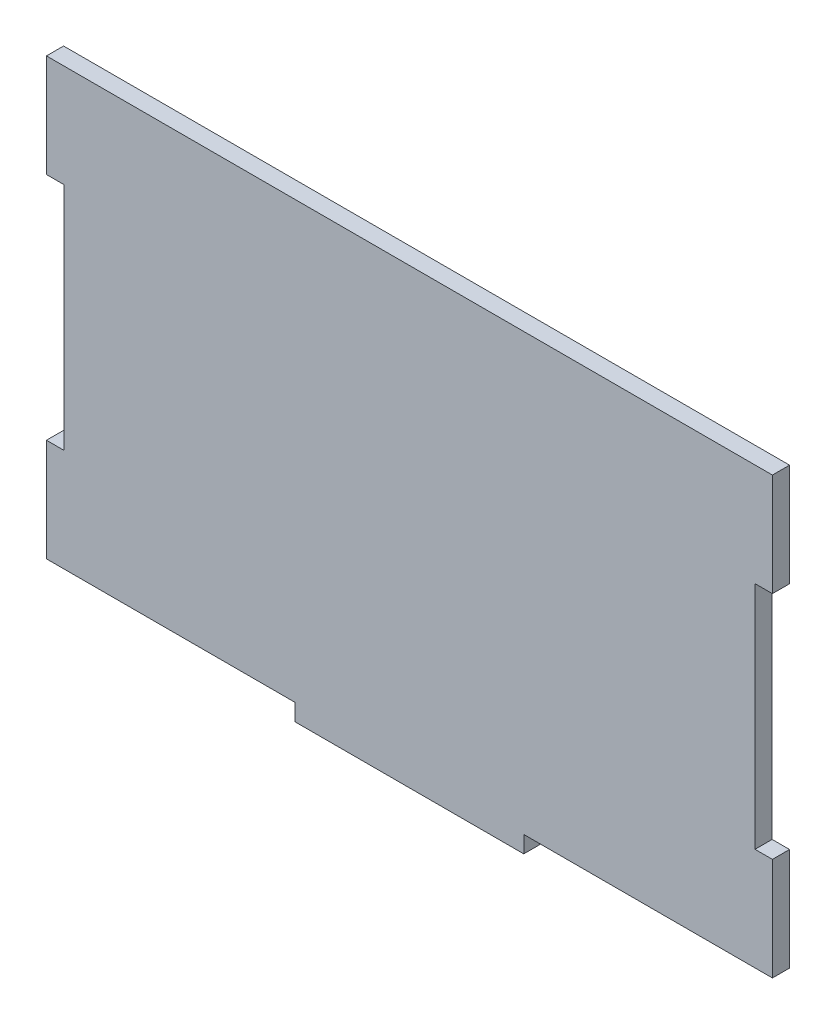
ISO-10303-21;
HEADER;
FILE_DESCRIPTION(('STEP AP214'),'2;1');
FILE_NAME('part.step','',(''),(''),'','','');
FILE_SCHEMA(('AUTOMOTIVE_DESIGN { 1 0 10303 214 1 1 1 1 }'));
ENDSEC;
DATA;
#1=APPLICATION_CONTEXT('core data for automotive mechanical design processes');
#2=APPLICATION_PROTOCOL_DEFINITION('international standard','automotive_design',2000,#1);
#3=PRODUCT_CONTEXT('',#1,'mechanical');
#4=PRODUCT('Part','Part','',(#3));
#5=PRODUCT_RELATED_PRODUCT_CATEGORY('part','',(#4));
#6=PRODUCT_DEFINITION_FORMATION('','',#4);
#7=PRODUCT_DEFINITION_CONTEXT('part definition',#1,'design');
#8=PRODUCT_DEFINITION('design','',#6,#7);
#9=PRODUCT_DEFINITION_SHAPE('','',#8);
#10=(LENGTH_UNIT() NAMED_UNIT(*) SI_UNIT(.MILLI.,.METRE.));
#11=(NAMED_UNIT(*) PLANE_ANGLE_UNIT() SI_UNIT($,.RADIAN.));
#12=(NAMED_UNIT(*) SI_UNIT($,.STERADIAN.) SOLID_ANGLE_UNIT());
#13=UNCERTAINTY_MEASURE_WITH_UNIT(LENGTH_MEASURE(1.E-05),#10,'distance_accuracy_value','');
#14=(GEOMETRIC_REPRESENTATION_CONTEXT(3) GLOBAL_UNCERTAINTY_ASSIGNED_CONTEXT((#13)) GLOBAL_UNIT_ASSIGNED_CONTEXT((#10,
#11,#12)) REPRESENTATION_CONTEXT('',''));
#15=CARTESIAN_POINT('',(0.,0.,0.));
#16=DIRECTION('',(0.,0.,1.));
#17=DIRECTION('',(1.,0.,0.));
#18=AXIS2_PLACEMENT_3D('',#15,#16,#17);
#19=CARTESIAN_POINT('',(-63.5,-38.1,1.4986));
#20=DIRECTION('',(0.,1.,0.));
#21=DIRECTION('',(0.,0.,1.));
#22=AXIS2_PLACEMENT_3D('',#19,#20,#21);
#23=PLANE('',#22);
#24=DIRECTION('',(0.,0.,1.));
#25=VECTOR('',#24,1.);
#26=CARTESIAN_POINT('',(20.,-38.1,-1.49865));
#27=LINE('',#26,#25);
#28=CARTESIAN_POINT('',(20.,-38.1,-1.4986));
#29=VERTEX_POINT('',#28);
#30=CARTESIAN_POINT('',(20.,-38.1,1.4986));
#31=VERTEX_POINT('',#30);
#32=EDGE_CURVE('E11',#29,#31,#27,.T.);
#33=ORIENTED_EDGE('',*,*,#32,.F.);
#34=DIRECTION('',(1.,0.,0.));
#35=VECTOR('',#34,1.);
#36=CARTESIAN_POINT('',(-63.5,-38.1,-1.4986));
#37=LINE('',#36,#35);
#38=CARTESIAN_POINT('',(63.5,-38.1,-1.4986));
#39=VERTEX_POINT('',#38);
#40=EDGE_CURVE('E235',#29,#39,#37,.T.);
#41=ORIENTED_EDGE('',*,*,#40,.T.);
#42=DIRECTION('',(0.,0.,-1.));
#43=VECTOR('',#42,1.);
#44=CARTESIAN_POINT('',(63.5,-38.1,1.4986));
#45=LINE('',#44,#43);
#46=CARTESIAN_POINT('',(63.5,-38.1,1.4986));
#47=VERTEX_POINT('',#46);
#48=EDGE_CURVE('E209',#47,#39,#45,.T.);
#49=ORIENTED_EDGE('',*,*,#48,.F.);
#50=DIRECTION('',(1.,0.,0.));
#51=VECTOR('',#50,1.);
#52=CARTESIAN_POINT('',(-63.5,-38.1,1.4986));
#53=LINE('',#52,#51);
#54=EDGE_CURVE('E191',#31,#47,#53,.T.);
#55=ORIENTED_EDGE('',*,*,#54,.F.);
#56=EDGE_LOOP('',(#33,#41,#49,#55));
#57=FACE_BOUND('',#56,.T.);
#58=ADVANCED_FACE('F32',(#57),#23,.F.);
#59=CARTESIAN_POINT('',(63.5,-38.1,1.4986));
#60=DIRECTION('',(-1.,0.,0.));
#61=DIRECTION('',(0.,0.,1.));
#62=AXIS2_PLACEMENT_3D('',#59,#60,#61);
#63=PLANE('',#62);
#64=DIRECTION('',(0.,1.,0.));
#65=VECTOR('',#64,1.);
#66=CARTESIAN_POINT('',(63.5,-38.1,1.4986));
#67=LINE('',#66,#65);
#68=CARTESIAN_POINT('',(63.5,20.127,1.4986));
#69=VERTEX_POINT('',#68);
#70=CARTESIAN_POINT('',(63.5,38.1,1.4986));
#71=VERTEX_POINT('',#70);
#72=EDGE_CURVE('E248',#69,#71,#67,.T.);
#73=ORIENTED_EDGE('',*,*,#72,.F.);
#74=DIRECTION('',(0.,0.,1.));
#75=VECTOR('',#74,1.);
#76=CARTESIAN_POINT('',(63.5,20.127,-1.4986));
#77=LINE('',#76,#75);
#78=CARTESIAN_POINT('',(63.5,20.127,-1.4986));
#79=VERTEX_POINT('',#78);
#80=EDGE_CURVE('E299',#79,#69,#77,.T.);
#81=ORIENTED_EDGE('',*,*,#80,.F.);
#82=DIRECTION('',(0.,1.,0.));
#83=VECTOR('',#82,1.);
#84=CARTESIAN_POINT('',(63.5,-38.1,-1.4986));
#85=LINE('',#84,#83);
#86=CARTESIAN_POINT('',(63.5,38.1,-1.4986));
#87=VERTEX_POINT('',#86);
#88=EDGE_CURVE('E230',#79,#87,#85,.T.);
#89=ORIENTED_EDGE('',*,*,#88,.T.);
#90=DIRECTION('',(0.,0.,-1.));
#91=VECTOR('',#90,1.);
#92=CARTESIAN_POINT('',(63.5,38.1,1.4986));
#93=LINE('',#92,#91);
#94=EDGE_CURVE('E190',#71,#87,#93,.T.);
#95=ORIENTED_EDGE('',*,*,#94,.F.);
#96=EDGE_LOOP('',(#73,#81,#89,#95));
#97=FACE_BOUND('',#96,.T.);
#98=ADVANCED_FACE('F342',(#97),#63,.F.);
#99=CARTESIAN_POINT('',(-63.5,-38.1,1.4986));
#100=DIRECTION('',(1.,0.,0.));
#101=DIRECTION('',(0.,0.,-1.));
#102=AXIS2_PLACEMENT_3D('',#99,#100,#101);
#103=PLANE('',#102);
#104=DIRECTION('',(0.,-1.,0.));
#105=VECTOR('',#104,1.);
#106=CARTESIAN_POINT('',(-63.5,-38.1,-1.4986));
#107=LINE('',#106,#105);
#108=CARTESIAN_POINT('',(-63.5,38.1,-1.4986));
#109=VERTEX_POINT('',#108);
#110=CARTESIAN_POINT('',(-63.5,20.127,-1.4986));
#111=VERTEX_POINT('',#110);
#112=EDGE_CURVE('E233',#109,#111,#107,.T.);
#113=ORIENTED_EDGE('',*,*,#112,.T.);
#114=DIRECTION('',(0.,0.,1.));
#115=VECTOR('',#114,1.);
#116=CARTESIAN_POINT('',(-63.5,20.127,-1.4986));
#117=LINE('',#116,#115);
#118=CARTESIAN_POINT('',(-63.5,20.127,1.4986));
#119=VERTEX_POINT('',#118);
#120=EDGE_CURVE('E272',#111,#119,#117,.T.);
#121=ORIENTED_EDGE('',*,*,#120,.T.);
#122=DIRECTION('',(0.,-1.,0.));
#123=VECTOR('',#122,1.);
#124=CARTESIAN_POINT('',(-63.5,-38.1,1.4986));
#125=LINE('',#124,#123);
#126=CARTESIAN_POINT('',(-63.5,38.1,1.4986));
#127=VERTEX_POINT('',#126);
#128=EDGE_CURVE('E214',#127,#119,#125,.T.);
#129=ORIENTED_EDGE('',*,*,#128,.F.);
#130=DIRECTION('',(0.,0.,-1.));
#131=VECTOR('',#130,1.);
#132=CARTESIAN_POINT('',(-63.5,38.1,1.4986));
#133=LINE('',#132,#131);
#134=EDGE_CURVE('E270',#127,#109,#133,.T.);
#135=ORIENTED_EDGE('',*,*,#134,.T.);
#136=EDGE_LOOP('',(#113,#121,#129,#135));
#137=FACE_BOUND('',#136,.T.);
#138=ADVANCED_FACE('F269',(#137),#103,.F.);
#139=CARTESIAN_POINT('',(63.5,-20.127,-1.4986));
#140=VERTEX_POINT('',#139);
#141=EDGE_CURVE('E225',#39,#140,#85,.T.);
#142=ORIENTED_EDGE('',*,*,#141,.T.);
#143=DIRECTION('',(0.,0.,1.));
#144=VECTOR('',#143,1.);
#145=CARTESIAN_POINT('',(63.5,-20.127,-1.4986));
#146=LINE('',#145,#144);
#147=CARTESIAN_POINT('',(63.5,-20.127,1.4986));
#148=VERTEX_POINT('',#147);
#149=EDGE_CURVE('E307',#140,#148,#146,.T.);
#150=ORIENTED_EDGE('',*,*,#149,.T.);
#151=EDGE_CURVE('E250',#47,#148,#67,.T.);
#152=ORIENTED_EDGE('',*,*,#151,.F.);
#153=ORIENTED_EDGE('',*,*,#48,.T.);
#154=EDGE_LOOP('',(#142,#150,#152,#153));
#155=FACE_BOUND('',#154,.T.);
#156=ADVANCED_FACE('F34',(#155),#63,.F.);
#157=CARTESIAN_POINT('',(-63.5,38.1,1.4986));
#158=DIRECTION('',(0.,-1.,0.));
#159=DIRECTION('',(0.,0.,-1.));
#160=AXIS2_PLACEMENT_3D('',#157,#158,#159);
#161=PLANE('',#160);
#162=DIRECTION('',(-1.,0.,0.));
#163=VECTOR('',#162,1.);
#164=CARTESIAN_POINT('',(-63.5,38.1,-1.4986));
#165=LINE('',#164,#163);
#166=EDGE_CURVE('E229',#87,#109,#165,.T.);
#167=ORIENTED_EDGE('',*,*,#166,.T.);
#168=ORIENTED_EDGE('',*,*,#134,.F.);
#169=DIRECTION('',(-1.,0.,0.));
#170=VECTOR('',#169,1.);
#171=CARTESIAN_POINT('',(-63.5,38.1,1.4986));
#172=LINE('',#171,#170);
#173=EDGE_CURVE('E256',#71,#127,#172,.T.);
#174=ORIENTED_EDGE('',*,*,#173,.F.);
#175=ORIENTED_EDGE('',*,*,#94,.T.);
#176=EDGE_LOOP('',(#167,#168,#174,#175));
#177=FACE_BOUND('',#176,.T.);
#178=ADVANCED_FACE('F352',(#177),#161,.F.);
#179=CARTESIAN_POINT('',(-63.5,-20.127,1.4986));
#180=VERTEX_POINT('',#179);
#181=CARTESIAN_POINT('',(-63.5,-38.1,1.4986));
#182=VERTEX_POINT('',#181);
#183=EDGE_CURVE('E205',#180,#182,#125,.T.);
#184=ORIENTED_EDGE('',*,*,#183,.F.);
#185=DIRECTION('',(0.,0.,1.));
#186=VECTOR('',#185,1.);
#187=CARTESIAN_POINT('',(-63.5,-20.127,-1.4986));
#188=LINE('',#187,#186);
#189=CARTESIAN_POINT('',(-63.5,-20.127,-1.4986));
#190=VERTEX_POINT('',#189);
#191=EDGE_CURVE('E258',#190,#180,#188,.T.);
#192=ORIENTED_EDGE('',*,*,#191,.F.);
#193=CARTESIAN_POINT('',(-63.5,-38.1,-1.4986));
#194=VERTEX_POINT('',#193);
#195=EDGE_CURVE('E232',#190,#194,#107,.T.);
#196=ORIENTED_EDGE('',*,*,#195,.T.);
#197=DIRECTION('',(0.,0.,-1.));
#198=VECTOR('',#197,1.);
#199=CARTESIAN_POINT('',(-63.5,-38.1,1.4986));
#200=LINE('',#199,#198);
#201=EDGE_CURVE('E212',#182,#194,#200,.T.);
#202=ORIENTED_EDGE('',*,*,#201,.F.);
#203=EDGE_LOOP('',(#184,#192,#196,#202));
#204=FACE_BOUND('',#203,.T.);
#205=ADVANCED_FACE('F350',(#204),#103,.F.);
#206=CARTESIAN_POINT('',(-20.,-38.1,-1.4986));
#207=VERTEX_POINT('',#206);
#208=EDGE_CURVE('E217',#194,#207,#37,.T.);
#209=ORIENTED_EDGE('',*,*,#208,.T.);
#210=DIRECTION('',(0.,0.,1.));
#211=VECTOR('',#210,1.);
#212=CARTESIAN_POINT('',(-20.,-38.1,-1.49865));
#213=LINE('',#212,#211);
#214=CARTESIAN_POINT('',(-20.,-38.1,1.4986));
#215=VERTEX_POINT('',#214);
#216=EDGE_CURVE('E41',#207,#215,#213,.T.);
#217=ORIENTED_EDGE('',*,*,#216,.T.);
#218=EDGE_CURVE('E202',#182,#215,#53,.T.);
#219=ORIENTED_EDGE('',*,*,#218,.F.);
#220=ORIENTED_EDGE('',*,*,#201,.T.);
#221=EDGE_LOOP('',(#209,#217,#219,#220));
#222=FACE_BOUND('',#221,.T.);
#223=ADVANCED_FACE('F348',(#222),#23,.F.);
#224=CARTESIAN_POINT('',(63.5,38.1,1.4986));
#225=DIRECTION('',(0.,0.,-1.));
#226=DIRECTION('',(-1.,0.,0.));
#227=AXIS2_PLACEMENT_3D('',#224,#225,#226);
#228=PLANE('',#227);
#229=DIRECTION('',(0.,-1.,0.));
#230=VECTOR('',#229,1.);
#231=CARTESIAN_POINT('',(60.452,20.127,1.4986));
#232=LINE('',#231,#230);
#233=CARTESIAN_POINT('',(60.452,20.127,1.4986));
#234=VERTEX_POINT('',#233);
#235=CARTESIAN_POINT('',(60.452,-20.127,1.4986));
#236=VERTEX_POINT('',#235);
#237=EDGE_CURVE('E314',#234,#236,#232,.T.);
#238=ORIENTED_EDGE('',*,*,#237,.F.);
#239=DIRECTION('',(-1.,0.,0.));
#240=VECTOR('',#239,1.);
#241=CARTESIAN_POINT('',(63.5,20.127,1.4986));
#242=LINE('',#241,#240);
#243=EDGE_CURVE('E184',#69,#234,#242,.T.);
#244=ORIENTED_EDGE('',*,*,#243,.F.);
#245=ORIENTED_EDGE('',*,*,#72,.T.);
#246=ORIENTED_EDGE('',*,*,#173,.T.);
#247=ORIENTED_EDGE('',*,*,#128,.T.);
#248=DIRECTION('',(-1.,0.,0.));
#249=VECTOR('',#248,1.);
#250=CARTESIAN_POINT('',(-63.5,20.127,1.4986));
#251=LINE('',#250,#249);
#252=CARTESIAN_POINT('',(-60.452,20.127,1.4986));
#253=VERTEX_POINT('',#252);
#254=EDGE_CURVE('E265',#253,#119,#251,.T.);
#255=ORIENTED_EDGE('',*,*,#254,.F.);
#256=DIRECTION('',(0.,1.,0.));
#257=VECTOR('',#256,1.);
#258=CARTESIAN_POINT('',(-60.452,20.127,1.4986));
#259=LINE('',#258,#257);
#260=CARTESIAN_POINT('',(-60.452,-20.127,1.4986));
#261=VERTEX_POINT('',#260);
#262=EDGE_CURVE('E298',#261,#253,#259,.T.);
#263=ORIENTED_EDGE('',*,*,#262,.F.);
#264=DIRECTION('',(1.,0.,0.));
#265=VECTOR('',#264,1.);
#266=CARTESIAN_POINT('',(-63.5,-20.127,1.4986));
#267=LINE('',#266,#265);
#268=EDGE_CURVE('E297',#180,#261,#267,.T.);
#269=ORIENTED_EDGE('',*,*,#268,.F.);
#270=ORIENTED_EDGE('',*,*,#183,.T.);
#271=ORIENTED_EDGE('',*,*,#218,.T.);
#272=DIRECTION('',(0.,-1.,0.));
#273=VECTOR('',#272,1.);
#274=CARTESIAN_POINT('',(-20.,-38.1,1.4986));
#275=LINE('',#274,#273);
#276=CARTESIAN_POINT('',(-20.,-41.0464,1.4986));
#277=VERTEX_POINT('',#276);
#278=EDGE_CURVE('E49',#215,#277,#275,.T.);
#279=ORIENTED_EDGE('',*,*,#278,.T.);
#280=DIRECTION('',(1.,0.,0.));
#281=VECTOR('',#280,1.);
#282=CARTESIAN_POINT('',(-20.,-41.0464,1.4986));
#283=LINE('',#282,#281);
#284=CARTESIAN_POINT('',(20.,-41.0464,1.4986));
#285=VERTEX_POINT('',#284);
#286=EDGE_CURVE('E157',#277,#285,#283,.T.);
#287=ORIENTED_EDGE('',*,*,#286,.T.);
#288=DIRECTION('',(0.,1.,0.));
#289=VECTOR('',#288,1.);
#290=CARTESIAN_POINT('',(20.,-38.1,1.4986));
#291=LINE('',#290,#289);
#292=EDGE_CURVE('E175',#285,#31,#291,.T.);
#293=ORIENTED_EDGE('',*,*,#292,.T.);
#294=ORIENTED_EDGE('',*,*,#54,.T.);
#295=ORIENTED_EDGE('',*,*,#151,.T.);
#296=DIRECTION('',(1.,0.,0.));
#297=VECTOR('',#296,1.);
#298=CARTESIAN_POINT('',(63.5,-20.127,1.4986));
#299=LINE('',#298,#297);
#300=EDGE_CURVE('E311',#236,#148,#299,.T.);
#301=ORIENTED_EDGE('',*,*,#300,.F.);
#302=EDGE_LOOP('',(#238,#244,#245,#246,#247,#255,#263,#269,#270,#271,#279,#287,#293,#294,#295,#301));
#303=FACE_BOUND('',#302,.T.);
#304=ADVANCED_FACE('F200',(#303),#228,.F.);
#305=CARTESIAN_POINT('',(63.5,38.1,-1.4986));
#306=DIRECTION('',(0.,0.,-1.));
#307=DIRECTION('',(-1.,0.,0.));
#308=AXIS2_PLACEMENT_3D('',#305,#306,#307);
#309=PLANE('',#308);
#310=DIRECTION('',(-1.,0.,0.));
#311=VECTOR('',#310,1.);
#312=CARTESIAN_POINT('',(63.5,20.127,-1.4986));
#313=LINE('',#312,#311);
#314=CARTESIAN_POINT('',(60.452,20.127,-1.4986));
#315=VERTEX_POINT('',#314);
#316=EDGE_CURVE('E313',#79,#315,#313,.T.);
#317=ORIENTED_EDGE('',*,*,#316,.T.);
#318=DIRECTION('',(0.,-1.,0.));
#319=VECTOR('',#318,1.);
#320=CARTESIAN_POINT('',(60.452,20.127,-1.4986));
#321=LINE('',#320,#319);
#322=CARTESIAN_POINT('',(60.452,-20.127,-1.4986));
#323=VERTEX_POINT('',#322);
#324=EDGE_CURVE('E320',#315,#323,#321,.T.);
#325=ORIENTED_EDGE('',*,*,#324,.T.);
#326=DIRECTION('',(1.,0.,0.));
#327=VECTOR('',#326,1.);
#328=CARTESIAN_POINT('',(63.5,-20.127,-1.4986));
#329=LINE('',#328,#327);
#330=EDGE_CURVE('E57',#323,#140,#329,.T.);
#331=ORIENTED_EDGE('',*,*,#330,.T.);
#332=ORIENTED_EDGE('',*,*,#141,.F.);
#333=ORIENTED_EDGE('',*,*,#40,.F.);
#334=EDGE_CURVE('E220',#207,#29,#37,.T.);
#335=ORIENTED_EDGE('',*,*,#334,.F.);
#336=ORIENTED_EDGE('',*,*,#208,.F.);
#337=ORIENTED_EDGE('',*,*,#195,.F.);
#338=DIRECTION('',(1.,0.,0.));
#339=VECTOR('',#338,1.);
#340=CARTESIAN_POINT('',(-63.5,-20.127,-1.4986));
#341=LINE('',#340,#339);
#342=CARTESIAN_POINT('',(-60.452,-20.127,-1.4986));
#343=VERTEX_POINT('',#342);
#344=EDGE_CURVE('E293',#190,#343,#341,.T.);
#345=ORIENTED_EDGE('',*,*,#344,.T.);
#346=DIRECTION('',(0.,1.,0.));
#347=VECTOR('',#346,1.);
#348=CARTESIAN_POINT('',(-60.452,20.127,-1.4986));
#349=LINE('',#348,#347);
#350=CARTESIAN_POINT('',(-60.452,20.127,-1.4986));
#351=VERTEX_POINT('',#350);
#352=EDGE_CURVE('E289',#343,#351,#349,.T.);
#353=ORIENTED_EDGE('',*,*,#352,.T.);
#354=DIRECTION('',(-1.,0.,0.));
#355=VECTOR('',#354,1.);
#356=CARTESIAN_POINT('',(-63.5,20.127,-1.4986));
#357=LINE('',#356,#355);
#358=EDGE_CURVE('E286',#351,#111,#357,.T.);
#359=ORIENTED_EDGE('',*,*,#358,.T.);
#360=ORIENTED_EDGE('',*,*,#112,.F.);
#361=ORIENTED_EDGE('',*,*,#166,.F.);
#362=ORIENTED_EDGE('',*,*,#88,.F.);
#363=EDGE_LOOP('',(#317,#325,#331,#332,#333,#335,#336,#337,#345,#353,#359,#360,#361,#362));
#364=FACE_BOUND('',#363,.T.);
#365=ADVANCED_FACE('F329',(#364),#309,.T.);
#366=CARTESIAN_POINT('',(-63.5,20.127,-1.4986));
#367=DIRECTION('',(0.,1.,0.));
#368=DIRECTION('',(0.,0.,1.));
#369=AXIS2_PLACEMENT_3D('',#366,#367,#368);
#370=PLANE('',#369);
#371=ORIENTED_EDGE('',*,*,#254,.T.);
#372=ORIENTED_EDGE('',*,*,#120,.F.);
#373=ORIENTED_EDGE('',*,*,#358,.F.);
#374=DIRECTION('',(0.,0.,1.));
#375=VECTOR('',#374,1.);
#376=CARTESIAN_POINT('',(-60.452,20.127,-1.4986));
#377=LINE('',#376,#375);
#378=EDGE_CURVE('E276',#351,#253,#377,.T.);
#379=ORIENTED_EDGE('',*,*,#378,.T.);
#380=EDGE_LOOP('',(#371,#372,#373,#379));
#381=FACE_BOUND('',#380,.T.);
#382=ADVANCED_FACE('F367',(#381),#370,.F.);
#383=CARTESIAN_POINT('',(-60.452,20.127,-1.4986));
#384=DIRECTION('',(1.,0.,0.));
#385=DIRECTION('',(0.,0.,-1.));
#386=AXIS2_PLACEMENT_3D('',#383,#384,#385);
#387=PLANE('',#386);
#388=ORIENTED_EDGE('',*,*,#262,.T.);
#389=ORIENTED_EDGE('',*,*,#378,.F.);
#390=ORIENTED_EDGE('',*,*,#352,.F.);
#391=DIRECTION('',(0.,0.,1.));
#392=VECTOR('',#391,1.);
#393=CARTESIAN_POINT('',(-60.452,-20.127,-1.4986));
#394=LINE('',#393,#392);
#395=EDGE_CURVE('E278',#343,#261,#394,.T.);
#396=ORIENTED_EDGE('',*,*,#395,.T.);
#397=EDGE_LOOP('',(#388,#389,#390,#396));
#398=FACE_BOUND('',#397,.T.);
#399=ADVANCED_FACE('F373',(#398),#387,.F.);
#400=CARTESIAN_POINT('',(-63.5,-20.127,-1.4986));
#401=DIRECTION('',(0.,-1.,0.));
#402=DIRECTION('',(0.,0.,-1.));
#403=AXIS2_PLACEMENT_3D('',#400,#401,#402);
#404=PLANE('',#403);
#405=ORIENTED_EDGE('',*,*,#268,.T.);
#406=ORIENTED_EDGE('',*,*,#395,.F.);
#407=ORIENTED_EDGE('',*,*,#344,.F.);
#408=ORIENTED_EDGE('',*,*,#191,.T.);
#409=EDGE_LOOP('',(#405,#406,#407,#408));
#410=FACE_BOUND('',#409,.T.);
#411=ADVANCED_FACE('F370',(#410),#404,.F.);
#412=CARTESIAN_POINT('',(63.5,20.127,-1.4986));
#413=DIRECTION('',(0.,1.,0.));
#414=DIRECTION('',(0.,0.,1.));
#415=AXIS2_PLACEMENT_3D('',#412,#413,#414);
#416=PLANE('',#415);
#417=ORIENTED_EDGE('',*,*,#243,.T.);
#418=DIRECTION('',(0.,0.,1.));
#419=VECTOR('',#418,1.);
#420=CARTESIAN_POINT('',(60.452,20.127,-1.4986));
#421=LINE('',#420,#419);
#422=EDGE_CURVE('E303',#315,#234,#421,.T.);
#423=ORIENTED_EDGE('',*,*,#422,.F.);
#424=ORIENTED_EDGE('',*,*,#316,.F.);
#425=ORIENTED_EDGE('',*,*,#80,.T.);
#426=EDGE_LOOP('',(#417,#423,#424,#425));
#427=FACE_BOUND('',#426,.T.);
#428=ADVANCED_FACE('F338',(#427),#416,.F.);
#429=CARTESIAN_POINT('',(63.5,-20.127,-1.4986));
#430=DIRECTION('',(0.,-1.,0.));
#431=DIRECTION('',(0.,0.,-1.));
#432=AXIS2_PLACEMENT_3D('',#429,#430,#431);
#433=PLANE('',#432);
#434=ORIENTED_EDGE('',*,*,#300,.T.);
#435=ORIENTED_EDGE('',*,*,#149,.F.);
#436=ORIENTED_EDGE('',*,*,#330,.F.);
#437=DIRECTION('',(0.,0.,1.));
#438=VECTOR('',#437,1.);
#439=CARTESIAN_POINT('',(60.452,-20.127,-1.4986));
#440=LINE('',#439,#438);
#441=EDGE_CURVE('E305',#323,#236,#440,.T.);
#442=ORIENTED_EDGE('',*,*,#441,.T.);
#443=EDGE_LOOP('',(#434,#435,#436,#442));
#444=FACE_BOUND('',#443,.T.);
#445=ADVANCED_FACE('F333',(#444),#433,.F.);
#446=CARTESIAN_POINT('',(60.452,20.127,-1.4986));
#447=DIRECTION('',(-1.,0.,0.));
#448=DIRECTION('',(0.,0.,1.));
#449=AXIS2_PLACEMENT_3D('',#446,#447,#448);
#450=PLANE('',#449);
#451=ORIENTED_EDGE('',*,*,#237,.T.);
#452=ORIENTED_EDGE('',*,*,#441,.F.);
#453=ORIENTED_EDGE('',*,*,#324,.F.);
#454=ORIENTED_EDGE('',*,*,#422,.T.);
#455=EDGE_LOOP('',(#451,#452,#453,#454));
#456=FACE_BOUND('',#455,.T.);
#457=ADVANCED_FACE('F336',(#456),#450,.F.);
#458=CARTESIAN_POINT('',(-20.,-38.1,-1.49865));
#459=DIRECTION('',(-1.,0.,0.));
#460=DIRECTION('',(0.,-1.,0.));
#461=AXIS2_PLACEMENT_3D('',#458,#459,#460);
#462=PLANE('',#461);
#463=ORIENTED_EDGE('',*,*,#278,.F.);
#464=ORIENTED_EDGE('',*,*,#216,.F.);
#465=CARTESIAN_POINT('',(-20.,-38.1,-1.49865));
#466=VERTEX_POINT('',#465);
#467=EDGE_CURVE('E174',#466,#207,#213,.T.);
#468=ORIENTED_EDGE('',*,*,#467,.F.);
#469=DIRECTION('',(0.,-1.,0.));
#470=VECTOR('',#469,1.);
#471=CARTESIAN_POINT('',(-20.,-38.1,-1.49865));
#472=LINE('',#471,#470);
#473=CARTESIAN_POINT('',(-20.,-41.0464,-1.49865));
#474=VERTEX_POINT('',#473);
#475=EDGE_CURVE('E167',#466,#474,#472,.T.);
#476=ORIENTED_EDGE('',*,*,#475,.T.);
#477=DIRECTION('',(0.,0.,1.));
#478=VECTOR('',#477,1.);
#479=CARTESIAN_POINT('',(-20.,-41.0464,-1.49865));
#480=LINE('',#479,#478);
#481=EDGE_CURVE('E152',#474,#277,#480,.T.);
#482=ORIENTED_EDGE('',*,*,#481,.T.);
#483=EDGE_LOOP('',(#463,#464,#468,#476,#482));
#484=FACE_BOUND('',#483,.T.);
#485=ADVANCED_FACE('F172',(#484),#462,.T.);
#486=CARTESIAN_POINT('',(-20.,-38.1,-1.49865));
#487=DIRECTION('',(0.,1.,0.));
#488=DIRECTION('',(0.,0.,1.));
#489=AXIS2_PLACEMENT_3D('',#486,#487,#488);
#490=PLANE('',#489);
#491=ORIENTED_EDGE('',*,*,#467,.T.);
#492=ORIENTED_EDGE('',*,*,#334,.T.);
#493=CARTESIAN_POINT('',(20.,-38.1,-1.49865));
#494=VERTEX_POINT('',#493);
#495=EDGE_CURVE('E185',#494,#29,#27,.T.);
#496=ORIENTED_EDGE('',*,*,#495,.F.);
#497=DIRECTION('',(-1.,0.,0.));
#498=VECTOR('',#497,1.);
#499=CARTESIAN_POINT('',(-20.,-38.1,-1.49865));
#500=LINE('',#499,#498);
#501=EDGE_CURVE('E160',#494,#466,#500,.T.);
#502=ORIENTED_EDGE('',*,*,#501,.T.);
#503=EDGE_LOOP('',(#491,#492,#496,#502));
#504=FACE_BOUND('',#503,.T.);
#505=ADVANCED_FACE('F386',(#504),#490,.T.);
#506=CARTESIAN_POINT('',(20.,-38.1,-1.49865));
#507=DIRECTION('',(1.,0.,0.));
#508=DIRECTION('',(0.,1.,0.));
#509=AXIS2_PLACEMENT_3D('',#506,#507,#508);
#510=PLANE('',#509);
#511=ORIENTED_EDGE('',*,*,#292,.F.);
#512=DIRECTION('',(0.,0.,1.));
#513=VECTOR('',#512,1.);
#514=CARTESIAN_POINT('',(20.,-41.0464,-1.49865));
#515=LINE('',#514,#513);
#516=CARTESIAN_POINT('',(20.,-41.0464,-1.49865));
#517=VERTEX_POINT('',#516);
#518=EDGE_CURVE('E159',#517,#285,#515,.T.);
#519=ORIENTED_EDGE('',*,*,#518,.F.);
#520=DIRECTION('',(0.,1.,0.));
#521=VECTOR('',#520,1.);
#522=CARTESIAN_POINT('',(20.,-38.1,-1.49865));
#523=LINE('',#522,#521);
#524=EDGE_CURVE('E170',#517,#494,#523,.T.);
#525=ORIENTED_EDGE('',*,*,#524,.T.);
#526=ORIENTED_EDGE('',*,*,#495,.T.);
#527=ORIENTED_EDGE('',*,*,#32,.T.);
#528=EDGE_LOOP('',(#511,#519,#525,#526,#527));
#529=FACE_BOUND('',#528,.T.);
#530=ADVANCED_FACE('F326',(#529),#510,.T.);
#531=CARTESIAN_POINT('',(-20.,-41.0464,-1.49865));
#532=DIRECTION('',(0.,-1.,0.));
#533=DIRECTION('',(0.,0.,-1.));
#534=AXIS2_PLACEMENT_3D('',#531,#532,#533);
#535=PLANE('',#534);
#536=ORIENTED_EDGE('',*,*,#286,.F.);
#537=ORIENTED_EDGE('',*,*,#481,.F.);
#538=DIRECTION('',(1.,0.,0.));
#539=VECTOR('',#538,1.);
#540=CARTESIAN_POINT('',(-20.,-41.0464,-1.49865));
#541=LINE('',#540,#539);
#542=EDGE_CURVE('E155',#474,#517,#541,.T.);
#543=ORIENTED_EDGE('',*,*,#542,.T.);
#544=ORIENTED_EDGE('',*,*,#518,.T.);
#545=EDGE_LOOP('',(#536,#537,#543,#544));
#546=FACE_BOUND('',#545,.T.);
#547=ADVANCED_FACE('F154',(#546),#535,.T.);
#548=CARTESIAN_POINT('',(-20.,-41.0464,-1.49865));
#549=DIRECTION('',(0.,0.,1.));
#550=DIRECTION('',(1.,0.,0.));
#551=AXIS2_PLACEMENT_3D('',#548,#549,#550);
#552=PLANE('',#551);
#553=ORIENTED_EDGE('',*,*,#475,.F.);
#554=ORIENTED_EDGE('',*,*,#501,.F.);
#555=ORIENTED_EDGE('',*,*,#524,.F.);
#556=ORIENTED_EDGE('',*,*,#542,.F.);
#557=EDGE_LOOP('',(#553,#554,#555,#556));
#558=FACE_BOUND('',#557,.T.);
#559=ADVANCED_FACE('F165',(#558),#552,.F.);
#560=CLOSED_SHELL('',(#58,#98,#138,#156,#178,#205,#223,#304,#365,#382,#399,#411,#428,#445,#457,
#485,#505,#530,#547,#559));
#561=MANIFOLD_SOLID_BREP('B2',#560);
#562=ADVANCED_BREP_SHAPE_REPRESENTATION('',(#18,#561),#14);
#563=SHAPE_DEFINITION_REPRESENTATION(#9,#562);
ENDSEC;
END-ISO-10303-21;
